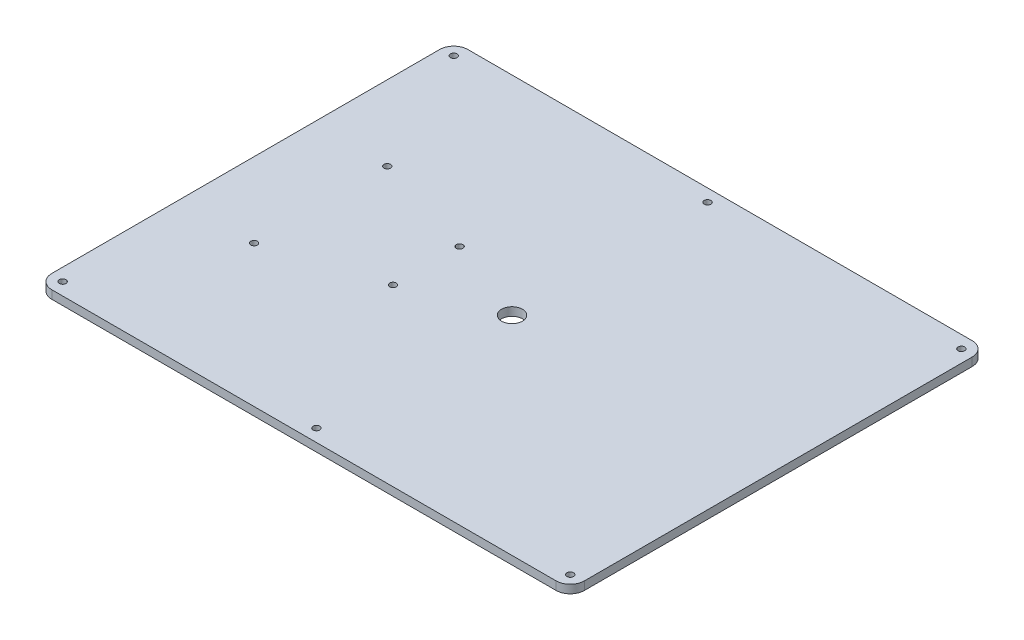
ISO-10303-21;
HEADER;
FILE_DESCRIPTION(('STEP AP214'),'2;1');
FILE_NAME('part.step','',(''),(''),'','','');
FILE_SCHEMA(('AUTOMOTIVE_DESIGN { 1 0 10303 214 1 1 1 1 }'));
ENDSEC;
DATA;
#1=APPLICATION_CONTEXT('core data for automotive mechanical design processes');
#2=APPLICATION_PROTOCOL_DEFINITION('international standard','automotive_design',2000,#1);
#3=PRODUCT_CONTEXT('',#1,'mechanical');
#4=PRODUCT('Part','Part','',(#3));
#5=PRODUCT_RELATED_PRODUCT_CATEGORY('part','',(#4));
#6=PRODUCT_DEFINITION_FORMATION('','',#4);
#7=PRODUCT_DEFINITION_CONTEXT('part definition',#1,'design');
#8=PRODUCT_DEFINITION('design','',#6,#7);
#9=PRODUCT_DEFINITION_SHAPE('','',#8);
#10=(LENGTH_UNIT() NAMED_UNIT(*) SI_UNIT(.MILLI.,.METRE.));
#11=(NAMED_UNIT(*) PLANE_ANGLE_UNIT() SI_UNIT($,.RADIAN.));
#12=(NAMED_UNIT(*) SI_UNIT($,.STERADIAN.) SOLID_ANGLE_UNIT());
#13=UNCERTAINTY_MEASURE_WITH_UNIT(LENGTH_MEASURE(1.E-05),#10,'distance_accuracy_value','');
#14=(GEOMETRIC_REPRESENTATION_CONTEXT(3) GLOBAL_UNCERTAINTY_ASSIGNED_CONTEXT((#13)) GLOBAL_UNIT_ASSIGNED_CONTEXT((#10,
#11,#12)) REPRESENTATION_CONTEXT('',''));
#15=CARTESIAN_POINT('',(0.,0.,0.));
#16=DIRECTION('',(0.,0.,1.));
#17=DIRECTION('',(1.,0.,0.));
#18=AXIS2_PLACEMENT_3D('',#15,#16,#17);
#19=CARTESIAN_POINT('',(-303.,10.,233.));
#20=DIRECTION('',(0.,1.,0.));
#21=DIRECTION('',(0.,0.,1.));
#22=AXIS2_PLACEMENT_3D('',#19,#20,#21);
#23=PLANE('',#22);
#24=CARTESIAN_POINT('',(-230.,10.,-80.));
#25=DIRECTION('',(0.,1.,0.));
#26=DIRECTION('',(0.,0.,1.));
#27=AXIS2_PLACEMENT_3D('',#24,#25,#26);
#28=CIRCLE('',#27,3.99999999999999);
#29=CARTESIAN_POINT('',(-230.,10.,-76.));
#30=VERTEX_POINT('',#29);
#31=EDGE_CURVE('E288',#30,#30,#28,.T.);
#32=ORIENTED_EDGE('',*,*,#31,.F.);
#33=EDGE_LOOP('',(#32));
#34=FACE_BOUND('',#33,.T.);
#35=CARTESIAN_POINT('',(-103.,10.,-40.));
#36=DIRECTION('',(0.,1.,0.));
#37=DIRECTION('',(0.,0.,1.));
#38=AXIS2_PLACEMENT_3D('',#35,#36,#37);
#39=CIRCLE('',#38,4.00000000000001);
#40=CARTESIAN_POINT('',(-103.,10.,-36.));
#41=VERTEX_POINT('',#40);
#42=EDGE_CURVE('E281',#41,#41,#39,.T.);
#43=ORIENTED_EDGE('',*,*,#42,.F.);
#44=EDGE_LOOP('',(#43));
#45=FACE_BOUND('',#44,.T.);
#46=CARTESIAN_POINT('',(0.,10.,0.));
#47=DIRECTION('',(0.,1.,0.));
#48=DIRECTION('',(0.,0.,1.));
#49=AXIS2_PLACEMENT_3D('',#46,#47,#48);
#50=CIRCLE('',#49,12.5);
#51=CARTESIAN_POINT('',(0.,10.,12.5));
#52=VERTEX_POINT('',#51);
#53=EDGE_CURVE('E273',#52,#52,#50,.T.);
#54=ORIENTED_EDGE('',*,*,#53,.F.);
#55=EDGE_LOOP('',(#54));
#56=FACE_BOUND('',#55,.T.);
#57=CARTESIAN_POINT('',(-103.,10.,40.));
#58=DIRECTION('',(0.,1.,0.));
#59=DIRECTION('',(0.,0.,-1.));
#60=AXIS2_PLACEMENT_3D('',#57,#58,#59);
#61=CIRCLE('',#60,4.00000000000001);
#62=CARTESIAN_POINT('',(-103.,10.,36.));
#63=VERTEX_POINT('',#62);
#64=EDGE_CURVE('E265',#63,#63,#61,.T.);
#65=ORIENTED_EDGE('',*,*,#64,.F.);
#66=EDGE_LOOP('',(#65));
#67=FACE_BOUND('',#66,.T.);
#68=CARTESIAN_POINT('',(-230.,10.,80.));
#69=DIRECTION('',(0.,1.,0.));
#70=DIRECTION('',(0.,0.,-1.));
#71=AXIS2_PLACEMENT_3D('',#68,#69,#70);
#72=CIRCLE('',#71,3.99999999999999);
#73=CARTESIAN_POINT('',(-230.,10.,76.0000000000001));
#74=VERTEX_POINT('',#73);
#75=EDGE_CURVE('E257',#74,#74,#72,.T.);
#76=ORIENTED_EDGE('',*,*,#75,.F.);
#77=EDGE_LOOP('',(#76));
#78=FACE_BOUND('',#77,.T.);
#79=CARTESIAN_POINT('',(305.,10.,235.));
#80=DIRECTION('',(0.,1.,0.));
#81=DIRECTION('',(0.,0.,1.));
#82=AXIS2_PLACEMENT_3D('',#79,#80,#81);
#83=CIRCLE('',#82,3.99999999999999);
#84=CARTESIAN_POINT('',(305.,10.,239.));
#85=VERTEX_POINT('',#84);
#86=EDGE_CURVE('E238',#85,#85,#83,.T.);
#87=ORIENTED_EDGE('',*,*,#86,.F.);
#88=EDGE_LOOP('',(#87));
#89=FACE_BOUND('',#88,.T.);
#90=CARTESIAN_POINT('',(-305.,10.,-235.));
#91=DIRECTION('',(0.,1.,0.));
#92=DIRECTION('',(0.,0.,1.));
#93=AXIS2_PLACEMENT_3D('',#90,#91,#92);
#94=CIRCLE('',#93,3.99999999999999);
#95=CARTESIAN_POINT('',(-305.,10.,-231.));
#96=VERTEX_POINT('',#95);
#97=EDGE_CURVE('E224',#96,#96,#94,.T.);
#98=ORIENTED_EDGE('',*,*,#97,.F.);
#99=EDGE_LOOP('',(#98));
#100=FACE_BOUND('',#99,.T.);
#101=CARTESIAN_POINT('',(0.,10.,-235.));
#102=DIRECTION('',(0.,1.,0.));
#103=DIRECTION('',(0.,0.,1.));
#104=AXIS2_PLACEMENT_3D('',#101,#102,#103);
#105=CIRCLE('',#104,4.);
#106=CARTESIAN_POINT('',(0.,10.,-231.));
#107=VERTEX_POINT('',#106);
#108=EDGE_CURVE('E152',#107,#107,#105,.T.);
#109=ORIENTED_EDGE('',*,*,#108,.F.);
#110=EDGE_LOOP('',(#109));
#111=FACE_BOUND('',#110,.T.);
#112=CARTESIAN_POINT('',(-303.,10.,233.));
#113=DIRECTION('',(0.,1.,0.));
#114=DIRECTION('',(0.,0.,1.));
#115=AXIS2_PLACEMENT_3D('',#112,#113,#114);
#116=CIRCLE('',#115,17.);
#117=CARTESIAN_POINT('',(-320.,10.,233.));
#118=VERTEX_POINT('',#117);
#119=CARTESIAN_POINT('',(-303.,10.,250.));
#120=VERTEX_POINT('',#119);
#121=EDGE_CURVE('E169',#118,#120,#116,.T.);
#122=ORIENTED_EDGE('',*,*,#121,.T.);
#123=DIRECTION('',(1.,0.,0.));
#124=VECTOR('',#123,1.);
#125=CARTESIAN_POINT('',(-303.,10.,250.));
#126=LINE('',#125,#124);
#127=CARTESIAN_POINT('',(303.,10.,250.));
#128=VERTEX_POINT('',#127);
#129=EDGE_CURVE('E104',#120,#128,#126,.T.);
#130=ORIENTED_EDGE('',*,*,#129,.T.);
#131=CARTESIAN_POINT('',(303.,10.,233.));
#132=DIRECTION('',(0.,1.,0.));
#133=DIRECTION('',(0.,0.,-1.));
#134=AXIS2_PLACEMENT_3D('',#131,#132,#133);
#135=CIRCLE('',#134,17.);
#136=CARTESIAN_POINT('',(320.,10.,233.));
#137=VERTEX_POINT('',#136);
#138=EDGE_CURVE('E189',#128,#137,#135,.T.);
#139=ORIENTED_EDGE('',*,*,#138,.T.);
#140=DIRECTION('',(0.,0.,-1.));
#141=VECTOR('',#140,1.);
#142=CARTESIAN_POINT('',(320.,10.,-233.));
#143=LINE('',#142,#141);
#144=CARTESIAN_POINT('',(320.,10.,-233.));
#145=VERTEX_POINT('',#144);
#146=EDGE_CURVE('E203',#137,#145,#143,.T.);
#147=ORIENTED_EDGE('',*,*,#146,.T.);
#148=CARTESIAN_POINT('',(303.,10.,-233.));
#149=DIRECTION('',(0.,1.,0.));
#150=DIRECTION('',(0.,0.,-1.));
#151=AXIS2_PLACEMENT_3D('',#148,#149,#150);
#152=CIRCLE('',#151,17.);
#153=CARTESIAN_POINT('',(303.,10.,-250.));
#154=VERTEX_POINT('',#153);
#155=EDGE_CURVE('E127',#145,#154,#152,.T.);
#156=ORIENTED_EDGE('',*,*,#155,.T.);
#157=DIRECTION('',(-1.,0.,0.));
#158=VECTOR('',#157,1.);
#159=CARTESIAN_POINT('',(-303.,10.,-250.));
#160=LINE('',#159,#158);
#161=CARTESIAN_POINT('',(-303.,10.,-250.));
#162=VERTEX_POINT('',#161);
#163=EDGE_CURVE('E121',#154,#162,#160,.T.);
#164=ORIENTED_EDGE('',*,*,#163,.T.);
#165=CARTESIAN_POINT('',(-303.,10.,-233.));
#166=DIRECTION('',(0.,1.,0.));
#167=DIRECTION('',(0.,0.,1.));
#168=AXIS2_PLACEMENT_3D('',#165,#166,#167);
#169=CIRCLE('',#168,17.);
#170=CARTESIAN_POINT('',(-320.,10.,-233.));
#171=VERTEX_POINT('',#170);
#172=EDGE_CURVE('E125',#162,#171,#169,.T.);
#173=ORIENTED_EDGE('',*,*,#172,.T.);
#174=DIRECTION('',(0.,0.,1.));
#175=VECTOR('',#174,1.);
#176=CARTESIAN_POINT('',(-320.,10.,-233.));
#177=LINE('',#176,#175);
#178=EDGE_CURVE('E56',#171,#118,#177,.T.);
#179=ORIENTED_EDGE('',*,*,#178,.T.);
#180=EDGE_LOOP('',(#122,#130,#139,#147,#156,#164,#173,#179));
#181=FACE_BOUND('',#180,.T.);
#182=CARTESIAN_POINT('',(305.,10.,-235.));
#183=DIRECTION('',(0.,1.,0.));
#184=DIRECTION('',(0.,0.,1.));
#185=AXIS2_PLACEMENT_3D('',#182,#183,#184);
#186=CIRCLE('',#185,3.99999999999999);
#187=CARTESIAN_POINT('',(305.,10.,-231.));
#188=VERTEX_POINT('',#187);
#189=EDGE_CURVE('E216',#188,#188,#186,.T.);
#190=ORIENTED_EDGE('',*,*,#189,.F.);
#191=EDGE_LOOP('',(#190));
#192=FACE_BOUND('',#191,.T.);
#193=CARTESIAN_POINT('',(0.,10.,235.));
#194=DIRECTION('',(0.,1.,0.));
#195=DIRECTION('',(0.,0.,1.));
#196=AXIS2_PLACEMENT_3D('',#193,#194,#195);
#197=CIRCLE('',#196,4.);
#198=CARTESIAN_POINT('',(0.,10.,239.));
#199=VERTEX_POINT('',#198);
#200=EDGE_CURVE('E231',#199,#199,#197,.T.);
#201=ORIENTED_EDGE('',*,*,#200,.F.);
#202=EDGE_LOOP('',(#201));
#203=FACE_BOUND('',#202,.T.);
#204=CARTESIAN_POINT('',(-305.,10.,235.));
#205=DIRECTION('',(0.,1.,0.));
#206=DIRECTION('',(0.,0.,1.));
#207=AXIS2_PLACEMENT_3D('',#204,#205,#206);
#208=CIRCLE('',#207,3.99999999999999);
#209=CARTESIAN_POINT('',(-305.,10.,239.));
#210=VERTEX_POINT('',#209);
#211=EDGE_CURVE('E246',#210,#210,#208,.T.);
#212=ORIENTED_EDGE('',*,*,#211,.F.);
#213=EDGE_LOOP('',(#212));
#214=FACE_BOUND('',#213,.T.);
#215=ADVANCED_FACE('F38',(#34,#45,#56,#67,#78,#89,#100,#111,#181,#192,#203,#214),#23,.T.);
#216=CARTESIAN_POINT('',(-303.,0.,233.));
#217=DIRECTION('',(0.,1.,0.));
#218=DIRECTION('',(0.,0.,1.));
#219=AXIS2_PLACEMENT_3D('',#216,#217,#218);
#220=PLANE('',#219);
#221=CARTESIAN_POINT('',(-230.,0.,-80.));
#222=DIRECTION('',(0.,1.,0.));
#223=DIRECTION('',(0.,0.,1.));
#224=AXIS2_PLACEMENT_3D('',#221,#222,#223);
#225=CIRCLE('',#224,3.99999999999999);
#226=CARTESIAN_POINT('',(-230.,0.,-76.));
#227=VERTEX_POINT('',#226);
#228=EDGE_CURVE('E254',#227,#227,#225,.T.);
#229=ORIENTED_EDGE('',*,*,#228,.T.);
#230=EDGE_LOOP('',(#229));
#231=FACE_BOUND('',#230,.T.);
#232=CARTESIAN_POINT('',(-103.,0.,-40.));
#233=DIRECTION('',(0.,1.,0.));
#234=DIRECTION('',(0.,0.,1.));
#235=AXIS2_PLACEMENT_3D('',#232,#233,#234);
#236=CIRCLE('',#235,4.00000000000001);
#237=CARTESIAN_POINT('',(-103.,0.,-36.));
#238=VERTEX_POINT('',#237);
#239=EDGE_CURVE('E284',#238,#238,#236,.T.);
#240=ORIENTED_EDGE('',*,*,#239,.T.);
#241=EDGE_LOOP('',(#240));
#242=FACE_BOUND('',#241,.T.);
#243=CARTESIAN_POINT('',(0.,0.,0.));
#244=DIRECTION('',(0.,1.,0.));
#245=DIRECTION('',(0.,0.,1.));
#246=AXIS2_PLACEMENT_3D('',#243,#244,#245);
#247=CIRCLE('',#246,12.5);
#248=CARTESIAN_POINT('',(0.,0.,12.5));
#249=VERTEX_POINT('',#248);
#250=EDGE_CURVE('E277',#249,#249,#247,.T.);
#251=ORIENTED_EDGE('',*,*,#250,.T.);
#252=EDGE_LOOP('',(#251));
#253=FACE_BOUND('',#252,.T.);
#254=CARTESIAN_POINT('',(-103.,0.,40.));
#255=DIRECTION('',(0.,1.,0.));
#256=DIRECTION('',(0.,0.,-1.));
#257=AXIS2_PLACEMENT_3D('',#254,#255,#256);
#258=CIRCLE('',#257,4.00000000000001);
#259=CARTESIAN_POINT('',(-103.,0.,36.));
#260=VERTEX_POINT('',#259);
#261=EDGE_CURVE('E269',#260,#260,#258,.T.);
#262=ORIENTED_EDGE('',*,*,#261,.T.);
#263=EDGE_LOOP('',(#262));
#264=FACE_BOUND('',#263,.T.);
#265=CARTESIAN_POINT('',(-230.,0.,80.));
#266=DIRECTION('',(0.,1.,0.));
#267=DIRECTION('',(0.,0.,-1.));
#268=AXIS2_PLACEMENT_3D('',#265,#266,#267);
#269=CIRCLE('',#268,3.99999999999999);
#270=CARTESIAN_POINT('',(-230.,0.,76.0000000000001));
#271=VERTEX_POINT('',#270);
#272=EDGE_CURVE('E261',#271,#271,#269,.T.);
#273=ORIENTED_EDGE('',*,*,#272,.T.);
#274=EDGE_LOOP('',(#273));
#275=FACE_BOUND('',#274,.T.);
#276=CARTESIAN_POINT('',(-303.,0.,233.));
#277=DIRECTION('',(0.,1.,0.));
#278=DIRECTION('',(0.,0.,1.));
#279=AXIS2_PLACEMENT_3D('',#276,#277,#278);
#280=CIRCLE('',#279,17.);
#281=CARTESIAN_POINT('',(-320.,0.,233.));
#282=VERTEX_POINT('',#281);
#283=CARTESIAN_POINT('',(-303.,0.,250.));
#284=VERTEX_POINT('',#283);
#285=EDGE_CURVE('E147',#282,#284,#280,.T.);
#286=ORIENTED_EDGE('',*,*,#285,.F.);
#287=DIRECTION('',(0.,0.,1.));
#288=VECTOR('',#287,1.);
#289=CARTESIAN_POINT('',(-320.,0.,-233.));
#290=LINE('',#289,#288);
#291=CARTESIAN_POINT('',(-320.,0.,-233.));
#292=VERTEX_POINT('',#291);
#293=EDGE_CURVE('E96',#292,#282,#290,.T.);
#294=ORIENTED_EDGE('',*,*,#293,.F.);
#295=CARTESIAN_POINT('',(-303.,0.,-233.));
#296=DIRECTION('',(0.,1.,0.));
#297=DIRECTION('',(0.,0.,1.));
#298=AXIS2_PLACEMENT_3D('',#295,#296,#297);
#299=CIRCLE('',#298,17.);
#300=CARTESIAN_POINT('',(-303.,0.,-250.));
#301=VERTEX_POINT('',#300);
#302=EDGE_CURVE('E90',#301,#292,#299,.T.);
#303=ORIENTED_EDGE('',*,*,#302,.F.);
#304=DIRECTION('',(-1.,0.,0.));
#305=VECTOR('',#304,1.);
#306=CARTESIAN_POINT('',(-303.,0.,-250.));
#307=LINE('',#306,#305);
#308=CARTESIAN_POINT('',(303.,0.,-250.));
#309=VERTEX_POINT('',#308);
#310=EDGE_CURVE('E136',#309,#301,#307,.T.);
#311=ORIENTED_EDGE('',*,*,#310,.F.);
#312=CARTESIAN_POINT('',(303.,0.,-233.));
#313=DIRECTION('',(0.,1.,0.));
#314=DIRECTION('',(0.,0.,-1.));
#315=AXIS2_PLACEMENT_3D('',#312,#313,#314);
#316=CIRCLE('',#315,17.);
#317=CARTESIAN_POINT('',(320.,0.,-233.));
#318=VERTEX_POINT('',#317);
#319=EDGE_CURVE('E161',#318,#309,#316,.T.);
#320=ORIENTED_EDGE('',*,*,#319,.F.);
#321=DIRECTION('',(0.,0.,-1.));
#322=VECTOR('',#321,1.);
#323=CARTESIAN_POINT('',(320.,0.,-233.));
#324=LINE('',#323,#322);
#325=CARTESIAN_POINT('',(320.,0.,233.));
#326=VERTEX_POINT('',#325);
#327=EDGE_CURVE('E158',#326,#318,#324,.T.);
#328=ORIENTED_EDGE('',*,*,#327,.F.);
#329=CARTESIAN_POINT('',(303.,0.,233.));
#330=DIRECTION('',(0.,1.,0.));
#331=DIRECTION('',(0.,0.,-1.));
#332=AXIS2_PLACEMENT_3D('',#329,#330,#331);
#333=CIRCLE('',#332,17.);
#334=CARTESIAN_POINT('',(303.,0.,250.));
#335=VERTEX_POINT('',#334);
#336=EDGE_CURVE('E155',#335,#326,#333,.T.);
#337=ORIENTED_EDGE('',*,*,#336,.F.);
#338=DIRECTION('',(1.,0.,0.));
#339=VECTOR('',#338,1.);
#340=CARTESIAN_POINT('',(-303.,0.,250.));
#341=LINE('',#340,#339);
#342=EDGE_CURVE('E151',#284,#335,#341,.T.);
#343=ORIENTED_EDGE('',*,*,#342,.F.);
#344=EDGE_LOOP('',(#286,#294,#303,#311,#320,#328,#337,#343));
#345=FACE_BOUND('',#344,.T.);
#346=CARTESIAN_POINT('',(0.,0.,-235.));
#347=DIRECTION('',(0.,1.,0.));
#348=DIRECTION('',(0.,0.,1.));
#349=AXIS2_PLACEMENT_3D('',#346,#347,#348);
#350=CIRCLE('',#349,4.);
#351=CARTESIAN_POINT('',(0.,0.,-231.));
#352=VERTEX_POINT('',#351);
#353=EDGE_CURVE('E212',#352,#352,#350,.T.);
#354=ORIENTED_EDGE('',*,*,#353,.T.);
#355=EDGE_LOOP('',(#354));
#356=FACE_BOUND('',#355,.T.);
#357=CARTESIAN_POINT('',(305.,0.,-235.));
#358=DIRECTION('',(0.,1.,0.));
#359=DIRECTION('',(0.,0.,1.));
#360=AXIS2_PLACEMENT_3D('',#357,#358,#359);
#361=CIRCLE('',#360,3.99999999999999);
#362=CARTESIAN_POINT('',(305.,0.,-231.));
#363=VERTEX_POINT('',#362);
#364=EDGE_CURVE('E220',#363,#363,#361,.T.);
#365=ORIENTED_EDGE('',*,*,#364,.T.);
#366=EDGE_LOOP('',(#365));
#367=FACE_BOUND('',#366,.T.);
#368=CARTESIAN_POINT('',(-305.,0.,-235.));
#369=DIRECTION('',(0.,1.,0.));
#370=DIRECTION('',(0.,0.,1.));
#371=AXIS2_PLACEMENT_3D('',#368,#369,#370);
#372=CIRCLE('',#371,3.99999999999999);
#373=CARTESIAN_POINT('',(-305.,0.,-231.));
#374=VERTEX_POINT('',#373);
#375=EDGE_CURVE('E228',#374,#374,#372,.T.);
#376=ORIENTED_EDGE('',*,*,#375,.T.);
#377=EDGE_LOOP('',(#376));
#378=FACE_BOUND('',#377,.T.);
#379=CARTESIAN_POINT('',(0.,0.,235.));
#380=DIRECTION('',(0.,1.,0.));
#381=DIRECTION('',(0.,0.,1.));
#382=AXIS2_PLACEMENT_3D('',#379,#380,#381);
#383=CIRCLE('',#382,4.);
#384=CARTESIAN_POINT('',(0.,0.,239.));
#385=VERTEX_POINT('',#384);
#386=EDGE_CURVE('E234',#385,#385,#383,.T.);
#387=ORIENTED_EDGE('',*,*,#386,.T.);
#388=EDGE_LOOP('',(#387));
#389=FACE_BOUND('',#388,.T.);
#390=CARTESIAN_POINT('',(305.,0.,235.));
#391=DIRECTION('',(0.,1.,0.));
#392=DIRECTION('',(0.,0.,1.));
#393=AXIS2_PLACEMENT_3D('',#390,#391,#392);
#394=CIRCLE('',#393,3.99999999999999);
#395=CARTESIAN_POINT('',(305.,0.,239.));
#396=VERTEX_POINT('',#395);
#397=EDGE_CURVE('E242',#396,#396,#394,.T.);
#398=ORIENTED_EDGE('',*,*,#397,.T.);
#399=EDGE_LOOP('',(#398));
#400=FACE_BOUND('',#399,.T.);
#401=CARTESIAN_POINT('',(-305.,0.,235.));
#402=DIRECTION('',(0.,1.,0.));
#403=DIRECTION('',(0.,0.,1.));
#404=AXIS2_PLACEMENT_3D('',#401,#402,#403);
#405=CIRCLE('',#404,3.99999999999999);
#406=CARTESIAN_POINT('',(-305.,0.,239.));
#407=VERTEX_POINT('',#406);
#408=EDGE_CURVE('E250',#407,#407,#405,.T.);
#409=ORIENTED_EDGE('',*,*,#408,.T.);
#410=EDGE_LOOP('',(#409));
#411=FACE_BOUND('',#410,.T.);
#412=ADVANCED_FACE('F193',(#231,#242,#253,#264,#275,#345,#356,#367,#378,#389,#400,#411),#220,.F.);
#413=CARTESIAN_POINT('',(-303.,10.,233.));
#414=DIRECTION('',(0.,-1.,0.));
#415=DIRECTION('',(0.,0.,-1.));
#416=AXIS2_PLACEMENT_3D('',#413,#414,#415);
#417=CYLINDRICAL_SURFACE('',#416,17.);
#418=ORIENTED_EDGE('',*,*,#285,.T.);
#419=DIRECTION('',(0.,-1.,0.));
#420=VECTOR('',#419,1.);
#421=CARTESIAN_POINT('',(-303.,10.,250.));
#422=LINE('',#421,#420);
#423=EDGE_CURVE('E11',#120,#284,#422,.T.);
#424=ORIENTED_EDGE('',*,*,#423,.F.);
#425=ORIENTED_EDGE('',*,*,#121,.F.);
#426=DIRECTION('',(0.,-1.,0.));
#427=VECTOR('',#426,1.);
#428=CARTESIAN_POINT('',(-320.,10.,233.));
#429=LINE('',#428,#427);
#430=EDGE_CURVE('E143',#118,#282,#429,.T.);
#431=ORIENTED_EDGE('',*,*,#430,.T.);
#432=EDGE_LOOP('',(#418,#424,#425,#431));
#433=FACE_BOUND('',#432,.T.);
#434=ADVANCED_FACE('F40',(#433),#417,.T.);
#435=CARTESIAN_POINT('',(-303.,10.,250.));
#436=DIRECTION('',(0.,0.,-1.));
#437=DIRECTION('',(-1.,0.,0.));
#438=AXIS2_PLACEMENT_3D('',#435,#436,#437);
#439=PLANE('',#438);
#440=ORIENTED_EDGE('',*,*,#342,.T.);
#441=DIRECTION('',(0.,-1.,0.));
#442=VECTOR('',#441,1.);
#443=CARTESIAN_POINT('',(303.,10.,250.));
#444=LINE('',#443,#442);
#445=EDGE_CURVE('E48',#128,#335,#444,.T.);
#446=ORIENTED_EDGE('',*,*,#445,.F.);
#447=ORIENTED_EDGE('',*,*,#129,.F.);
#448=ORIENTED_EDGE('',*,*,#423,.T.);
#449=EDGE_LOOP('',(#440,#446,#447,#448));
#450=FACE_BOUND('',#449,.T.);
#451=ADVANCED_FACE('F381',(#450),#439,.F.);
#452=CARTESIAN_POINT('',(303.,10.,233.));
#453=DIRECTION('',(0.,-1.,0.));
#454=DIRECTION('',(0.,0.,-1.));
#455=AXIS2_PLACEMENT_3D('',#452,#453,#454);
#456=CYLINDRICAL_SURFACE('',#455,17.);
#457=ORIENTED_EDGE('',*,*,#336,.T.);
#458=DIRECTION('',(0.,-1.,0.));
#459=VECTOR('',#458,1.);
#460=CARTESIAN_POINT('',(320.,10.,233.));
#461=LINE('',#460,#459);
#462=EDGE_CURVE('E178',#137,#326,#461,.T.);
#463=ORIENTED_EDGE('',*,*,#462,.F.);
#464=ORIENTED_EDGE('',*,*,#138,.F.);
#465=ORIENTED_EDGE('',*,*,#445,.T.);
#466=EDGE_LOOP('',(#457,#463,#464,#465));
#467=FACE_BOUND('',#466,.T.);
#468=ADVANCED_FACE('F187',(#467),#456,.T.);
#469=CARTESIAN_POINT('',(320.,10.,-233.));
#470=DIRECTION('',(-1.,0.,0.));
#471=DIRECTION('',(0.,0.,1.));
#472=AXIS2_PLACEMENT_3D('',#469,#470,#471);
#473=PLANE('',#472);
#474=ORIENTED_EDGE('',*,*,#327,.T.);
#475=DIRECTION('',(0.,-1.,0.));
#476=VECTOR('',#475,1.);
#477=CARTESIAN_POINT('',(320.,10.,-233.));
#478=LINE('',#477,#476);
#479=EDGE_CURVE('E174',#145,#318,#478,.T.);
#480=ORIENTED_EDGE('',*,*,#479,.F.);
#481=ORIENTED_EDGE('',*,*,#146,.F.);
#482=ORIENTED_EDGE('',*,*,#462,.T.);
#483=EDGE_LOOP('',(#474,#480,#481,#482));
#484=FACE_BOUND('',#483,.T.);
#485=ADVANCED_FACE('F198',(#484),#473,.F.);
#486=CARTESIAN_POINT('',(303.,10.,-233.));
#487=DIRECTION('',(0.,-1.,0.));
#488=DIRECTION('',(0.,0.,-1.));
#489=AXIS2_PLACEMENT_3D('',#486,#487,#488);
#490=CYLINDRICAL_SURFACE('',#489,17.);
#491=ORIENTED_EDGE('',*,*,#319,.T.);
#492=DIRECTION('',(0.,-1.,0.));
#493=VECTOR('',#492,1.);
#494=CARTESIAN_POINT('',(303.,10.,-250.));
#495=LINE('',#494,#493);
#496=EDGE_CURVE('E137',#154,#309,#495,.T.);
#497=ORIENTED_EDGE('',*,*,#496,.F.);
#498=ORIENTED_EDGE('',*,*,#155,.F.);
#499=ORIENTED_EDGE('',*,*,#479,.T.);
#500=EDGE_LOOP('',(#491,#497,#498,#499));
#501=FACE_BOUND('',#500,.T.);
#502=ADVANCED_FACE('F201',(#501),#490,.T.);
#503=CARTESIAN_POINT('',(-303.,10.,-250.));
#504=DIRECTION('',(0.,0.,1.));
#505=DIRECTION('',(1.,0.,0.));
#506=AXIS2_PLACEMENT_3D('',#503,#504,#505);
#507=PLANE('',#506);
#508=ORIENTED_EDGE('',*,*,#310,.T.);
#509=DIRECTION('',(0.,-1.,0.));
#510=VECTOR('',#509,1.);
#511=CARTESIAN_POINT('',(-303.,10.,-250.));
#512=LINE('',#511,#510);
#513=EDGE_CURVE('E133',#162,#301,#512,.T.);
#514=ORIENTED_EDGE('',*,*,#513,.F.);
#515=ORIENTED_EDGE('',*,*,#163,.F.);
#516=ORIENTED_EDGE('',*,*,#496,.T.);
#517=EDGE_LOOP('',(#508,#514,#515,#516));
#518=FACE_BOUND('',#517,.T.);
#519=ADVANCED_FACE('F134',(#518),#507,.F.);
#520=CARTESIAN_POINT('',(-303.,10.,-233.));
#521=DIRECTION('',(0.,-1.,0.));
#522=DIRECTION('',(0.,0.,-1.));
#523=AXIS2_PLACEMENT_3D('',#520,#521,#522);
#524=CYLINDRICAL_SURFACE('',#523,17.);
#525=ORIENTED_EDGE('',*,*,#302,.T.);
#526=DIRECTION('',(0.,-1.,0.));
#527=VECTOR('',#526,1.);
#528=CARTESIAN_POINT('',(-320.,10.,-233.));
#529=LINE('',#528,#527);
#530=EDGE_CURVE('E138',#171,#292,#529,.T.);
#531=ORIENTED_EDGE('',*,*,#530,.F.);
#532=ORIENTED_EDGE('',*,*,#172,.F.);
#533=ORIENTED_EDGE('',*,*,#513,.T.);
#534=EDGE_LOOP('',(#525,#531,#532,#533));
#535=FACE_BOUND('',#534,.T.);
#536=ADVANCED_FACE('F140',(#535),#524,.T.);
#537=CARTESIAN_POINT('',(-320.,10.,-233.));
#538=DIRECTION('',(1.,0.,0.));
#539=DIRECTION('',(0.,0.,-1.));
#540=AXIS2_PLACEMENT_3D('',#537,#538,#539);
#541=PLANE('',#540);
#542=ORIENTED_EDGE('',*,*,#293,.T.);
#543=ORIENTED_EDGE('',*,*,#430,.F.);
#544=ORIENTED_EDGE('',*,*,#178,.F.);
#545=ORIENTED_EDGE('',*,*,#530,.T.);
#546=EDGE_LOOP('',(#542,#543,#544,#545));
#547=FACE_BOUND('',#546,.T.);
#548=ADVANCED_FACE('F326',(#547),#541,.F.);
#549=CARTESIAN_POINT('',(0.,10.,-235.));
#550=DIRECTION('',(0.,-1.,0.));
#551=DIRECTION('',(0.,0.,-1.));
#552=AXIS2_PLACEMENT_3D('',#549,#550,#551);
#553=CYLINDRICAL_SURFACE('',#552,4.);
#554=ORIENTED_EDGE('',*,*,#108,.T.);
#555=EDGE_LOOP('',(#554));
#556=FACE_BOUND('',#555,.T.);
#557=ORIENTED_EDGE('',*,*,#353,.F.);
#558=EDGE_LOOP('',(#557));
#559=FACE_BOUND('',#558,.T.);
#560=ADVANCED_FACE('F322',(#556,#559),#553,.F.);
#561=CARTESIAN_POINT('',(305.,10.,-235.));
#562=DIRECTION('',(0.,-1.,0.));
#563=DIRECTION('',(0.,0.,-1.));
#564=AXIS2_PLACEMENT_3D('',#561,#562,#563);
#565=CYLINDRICAL_SURFACE('',#564,3.99999999999999);
#566=ORIENTED_EDGE('',*,*,#189,.T.);
#567=EDGE_LOOP('',(#566));
#568=FACE_BOUND('',#567,.T.);
#569=ORIENTED_EDGE('',*,*,#364,.F.);
#570=EDGE_LOOP('',(#569));
#571=FACE_BOUND('',#570,.T.);
#572=ADVANCED_FACE('F325',(#568,#571),#565,.F.);
#573=CARTESIAN_POINT('',(-305.,10.,-235.));
#574=DIRECTION('',(0.,-1.,0.));
#575=DIRECTION('',(0.,0.,-1.));
#576=AXIS2_PLACEMENT_3D('',#573,#574,#575);
#577=CYLINDRICAL_SURFACE('',#576,3.99999999999999);
#578=ORIENTED_EDGE('',*,*,#97,.T.);
#579=EDGE_LOOP('',(#578));
#580=FACE_BOUND('',#579,.T.);
#581=ORIENTED_EDGE('',*,*,#375,.F.);
#582=EDGE_LOOP('',(#581));
#583=FACE_BOUND('',#582,.T.);
#584=ADVANCED_FACE('F362',(#580,#583),#577,.F.);
#585=CARTESIAN_POINT('',(0.,10.,235.));
#586=DIRECTION('',(0.,-1.,0.));
#587=DIRECTION('',(0.,0.,-1.));
#588=AXIS2_PLACEMENT_3D('',#585,#586,#587);
#589=CYLINDRICAL_SURFACE('',#588,4.);
#590=ORIENTED_EDGE('',*,*,#200,.T.);
#591=EDGE_LOOP('',(#590));
#592=FACE_BOUND('',#591,.T.);
#593=ORIENTED_EDGE('',*,*,#386,.F.);
#594=EDGE_LOOP('',(#593));
#595=FACE_BOUND('',#594,.T.);
#596=ADVANCED_FACE('F355',(#592,#595),#589,.F.);
#597=CARTESIAN_POINT('',(305.,10.,235.));
#598=DIRECTION('',(0.,-1.,0.));
#599=DIRECTION('',(0.,0.,-1.));
#600=AXIS2_PLACEMENT_3D('',#597,#598,#599);
#601=CYLINDRICAL_SURFACE('',#600,3.99999999999999);
#602=ORIENTED_EDGE('',*,*,#86,.T.);
#603=EDGE_LOOP('',(#602));
#604=FACE_BOUND('',#603,.T.);
#605=ORIENTED_EDGE('',*,*,#397,.F.);
#606=EDGE_LOOP('',(#605));
#607=FACE_BOUND('',#606,.T.);
#608=ADVANCED_FACE('F345',(#604,#607),#601,.F.);
#609=CARTESIAN_POINT('',(-305.,10.,235.));
#610=DIRECTION('',(0.,-1.,0.));
#611=DIRECTION('',(0.,0.,-1.));
#612=AXIS2_PLACEMENT_3D('',#609,#610,#611);
#613=CYLINDRICAL_SURFACE('',#612,3.99999999999999);
#614=ORIENTED_EDGE('',*,*,#211,.T.);
#615=EDGE_LOOP('',(#614));
#616=FACE_BOUND('',#615,.T.);
#617=ORIENTED_EDGE('',*,*,#408,.F.);
#618=EDGE_LOOP('',(#617));
#619=FACE_BOUND('',#618,.T.);
#620=ADVANCED_FACE('F342',(#616,#619),#613,.F.);
#621=CARTESIAN_POINT('',(-230.,0.,80.));
#622=DIRECTION('',(0.,1.,0.));
#623=DIRECTION('',(0.,0.,1.));
#624=AXIS2_PLACEMENT_3D('',#621,#622,#623);
#625=CYLINDRICAL_SURFACE('',#624,3.99999999999999);
#626=ORIENTED_EDGE('',*,*,#272,.F.);
#627=EDGE_LOOP('',(#626));
#628=FACE_BOUND('',#627,.T.);
#629=ORIENTED_EDGE('',*,*,#75,.T.);
#630=EDGE_LOOP('',(#629));
#631=FACE_BOUND('',#630,.T.);
#632=ADVANCED_FACE('F344',(#628,#631),#625,.F.);
#633=CARTESIAN_POINT('',(-103.,0.,40.));
#634=DIRECTION('',(0.,1.,0.));
#635=DIRECTION('',(0.,0.,1.));
#636=AXIS2_PLACEMENT_3D('',#633,#634,#635);
#637=CYLINDRICAL_SURFACE('',#636,4.00000000000001);
#638=ORIENTED_EDGE('',*,*,#261,.F.);
#639=EDGE_LOOP('',(#638));
#640=FACE_BOUND('',#639,.T.);
#641=ORIENTED_EDGE('',*,*,#64,.T.);
#642=EDGE_LOOP('',(#641));
#643=FACE_BOUND('',#642,.T.);
#644=ADVANCED_FACE('F352',(#640,#643),#637,.F.);
#645=CARTESIAN_POINT('',(0.,0.,0.));
#646=DIRECTION('',(0.,1.,0.));
#647=DIRECTION('',(0.,0.,1.));
#648=AXIS2_PLACEMENT_3D('',#645,#646,#647);
#649=CYLINDRICAL_SURFACE('',#648,12.5);
#650=ORIENTED_EDGE('',*,*,#250,.F.);
#651=EDGE_LOOP('',(#650));
#652=FACE_BOUND('',#651,.T.);
#653=ORIENTED_EDGE('',*,*,#53,.T.);
#654=EDGE_LOOP('',(#653));
#655=FACE_BOUND('',#654,.T.);
#656=ADVANCED_FACE('F422',(#652,#655),#649,.F.);
#657=CARTESIAN_POINT('',(-103.,0.,-40.));
#658=DIRECTION('',(0.,1.,0.));
#659=DIRECTION('',(0.,0.,1.));
#660=AXIS2_PLACEMENT_3D('',#657,#658,#659);
#661=CYLINDRICAL_SURFACE('',#660,4.00000000000001);
#662=ORIENTED_EDGE('',*,*,#239,.F.);
#663=EDGE_LOOP('',(#662));
#664=FACE_BOUND('',#663,.T.);
#665=ORIENTED_EDGE('',*,*,#42,.T.);
#666=EDGE_LOOP('',(#665));
#667=FACE_BOUND('',#666,.T.);
#668=ADVANCED_FACE('F301',(#664,#667),#661,.F.);
#669=CARTESIAN_POINT('',(-230.,0.,-80.));
#670=DIRECTION('',(0.,1.,0.));
#671=DIRECTION('',(0.,0.,1.));
#672=AXIS2_PLACEMENT_3D('',#669,#670,#671);
#673=CYLINDRICAL_SURFACE('',#672,3.99999999999999);
#674=ORIENTED_EDGE('',*,*,#228,.F.);
#675=EDGE_LOOP('',(#674));
#676=FACE_BOUND('',#675,.T.);
#677=ORIENTED_EDGE('',*,*,#31,.T.);
#678=EDGE_LOOP('',(#677));
#679=FACE_BOUND('',#678,.T.);
#680=ADVANCED_FACE('F298',(#676,#679),#673,.F.);
#681=CLOSED_SHELL('',(#215,#412,#434,#451,#468,#485,#502,#519,#536,#548,#560,#572,#584,#596,
#608,#620,#632,#644,#656,#668,#680));
#682=MANIFOLD_SOLID_BREP('B2',#681);
#683=ADVANCED_BREP_SHAPE_REPRESENTATION('',(#18,#682),#14);
#684=SHAPE_DEFINITION_REPRESENTATION(#9,#683);
ENDSEC;
END-ISO-10303-21;
